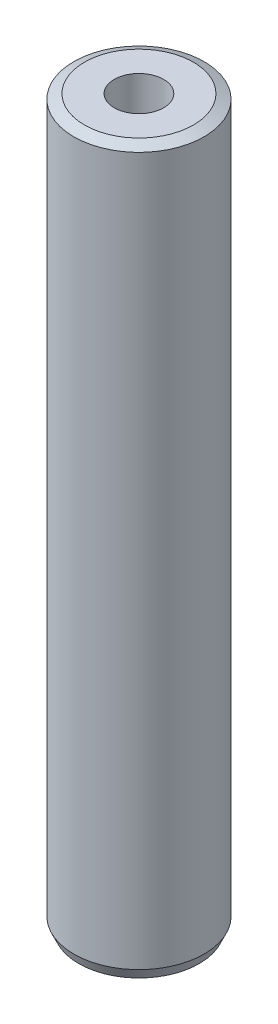
ISO-10303-21;
HEADER;
FILE_DESCRIPTION(('STEP AP214'),'2;1');
FILE_NAME('part.step','',(''),(''),'','','');
FILE_SCHEMA(('AUTOMOTIVE_DESIGN { 1 0 10303 214 1 1 1 1 }'));
ENDSEC;
DATA;
#1=APPLICATION_CONTEXT('core data for automotive mechanical design processes');
#2=APPLICATION_PROTOCOL_DEFINITION('international standard','automotive_design',2000,#1);
#3=PRODUCT_CONTEXT('',#1,'mechanical');
#4=PRODUCT('Part','Part','',(#3));
#5=PRODUCT_RELATED_PRODUCT_CATEGORY('part','',(#4));
#6=PRODUCT_DEFINITION_FORMATION('','',#4);
#7=PRODUCT_DEFINITION_CONTEXT('part definition',#1,'design');
#8=PRODUCT_DEFINITION('design','',#6,#7);
#9=PRODUCT_DEFINITION_SHAPE('','',#8);
#10=(LENGTH_UNIT() NAMED_UNIT(*) SI_UNIT(.MILLI.,.METRE.));
#11=(NAMED_UNIT(*) PLANE_ANGLE_UNIT() SI_UNIT($,.RADIAN.));
#12=(NAMED_UNIT(*) SI_UNIT($,.STERADIAN.) SOLID_ANGLE_UNIT());
#13=UNCERTAINTY_MEASURE_WITH_UNIT(LENGTH_MEASURE(1.E-05),#10,'distance_accuracy_value','');
#14=(GEOMETRIC_REPRESENTATION_CONTEXT(3) GLOBAL_UNCERTAINTY_ASSIGNED_CONTEXT((#13)) GLOBAL_UNIT_ASSIGNED_CONTEXT((#10,
#11,#12)) REPRESENTATION_CONTEXT('',''));
#15=CARTESIAN_POINT('',(0.,0.,0.));
#16=DIRECTION('',(0.,0.,1.));
#17=DIRECTION('',(1.,0.,0.));
#18=AXIS2_PLACEMENT_3D('',#15,#16,#17);
#19=CARTESIAN_POINT('',(0.,416.345028660656,0.));
#20=DIRECTION('',(0.,-1.,0.));
#21=DIRECTION('',(0.,0.,-1.));
#22=AXIS2_PLACEMENT_3D('',#19,#20,#21);
#23=CYLINDRICAL_SURFACE('',#22,37.5);
#24=CARTESIAN_POINT('',(0.,413.551676634569,0.));
#25=DIRECTION('',(0.,1.,0.));
#26=DIRECTION('',(0.,0.,1.));
#27=AXIS2_PLACEMENT_3D('',#24,#25,#26);
#28=CIRCLE('',#27,37.5);
#29=CARTESIAN_POINT('',(0.,413.551676634569,37.5));
#30=VERTEX_POINT('',#29);
#31=EDGE_CURVE('E50',#30,#30,#28,.F.);
#32=ORIENTED_EDGE('',*,*,#31,.T.);
#33=EDGE_LOOP('',(#32));
#34=FACE_BOUND('',#33,.T.);
#35=CARTESIAN_POINT('',(0.,6.15230423809254,0.));
#36=DIRECTION('',(0.,1.,0.));
#37=DIRECTION('',(0.,0.,1.));
#38=AXIS2_PLACEMENT_3D('',#35,#36,#37);
#39=CIRCLE('',#38,37.5);
#40=CARTESIAN_POINT('',(0.,6.15230423809254,37.5));
#41=VERTEX_POINT('',#40);
#42=EDGE_CURVE('E51',#41,#41,#39,.T.);
#43=ORIENTED_EDGE('',*,*,#42,.T.);
#44=EDGE_LOOP('',(#43));
#45=FACE_BOUND('',#44,.T.);
#46=ADVANCED_FACE('F39',(#34,#45),#23,.T.);
#47=CARTESIAN_POINT('',(0.,416.345028660656,0.));
#48=DIRECTION('',(0.,1.,0.));
#49=DIRECTION('',(0.,0.,1.));
#50=AXIS2_PLACEMENT_3D('',#47,#48,#49);
#51=PLANE('',#50);
#52=CARTESIAN_POINT('',(0.,416.345028660656,0.));
#53=DIRECTION('',(0.,1.,0.));
#54=DIRECTION('',(0.,0.,1.));
#55=AXIS2_PLACEMENT_3D('',#52,#53,#54);
#56=CIRCLE('',#55,31.3476957619075);
#57=CARTESIAN_POINT('',(0.,416.345028660656,31.3476957619075));
#58=VERTEX_POINT('',#57);
#59=EDGE_CURVE('E54',#58,#58,#56,.T.);
#60=ORIENTED_EDGE('',*,*,#59,.T.);
#61=EDGE_LOOP('',(#60));
#62=FACE_BOUND('',#61,.T.);
#63=CARTESIAN_POINT('',(0.,416.345028660656,0.));
#64=DIRECTION('',(0.,1.,0.));
#65=DIRECTION('',(0.,0.,1.));
#66=AXIS2_PLACEMENT_3D('',#63,#64,#65);
#67=CIRCLE('',#66,14.199533645004);
#68=CARTESIAN_POINT('',(0.,416.345028660656,14.199533645004));
#69=VERTEX_POINT('',#68);
#70=EDGE_CURVE('E58',#69,#69,#67,.T.);
#71=ORIENTED_EDGE('',*,*,#70,.F.);
#72=EDGE_LOOP('',(#71));
#73=FACE_BOUND('',#72,.T.);
#74=ADVANCED_FACE('F69',(#62,#73),#51,.T.);
#75=CARTESIAN_POINT('',(0.,0.,0.));
#76=DIRECTION('',(0.,1.,0.));
#77=DIRECTION('',(0.,0.,1.));
#78=AXIS2_PLACEMENT_3D('',#75,#76,#77);
#79=PLANE('',#78);
#80=CARTESIAN_POINT('',(0.,0.,0.));
#81=DIRECTION('',(0.,1.,0.));
#82=DIRECTION('',(0.,0.,1.));
#83=AXIS2_PLACEMENT_3D('',#80,#81,#82);
#84=CIRCLE('',#83,34.7066479739125);
#85=CARTESIAN_POINT('',(0.,0.,34.7066479739125));
#86=VERTEX_POINT('',#85);
#87=EDGE_CURVE('E10',#86,#86,#84,.F.);
#88=ORIENTED_EDGE('',*,*,#87,.T.);
#89=EDGE_LOOP('',(#88));
#90=FACE_BOUND('',#89,.T.);
#91=CARTESIAN_POINT('',(0.,0.,0.));
#92=DIRECTION('',(0.,1.,0.));
#93=DIRECTION('',(0.,0.,1.));
#94=AXIS2_PLACEMENT_3D('',#91,#92,#93);
#95=CIRCLE('',#94,14.199533645004);
#96=CARTESIAN_POINT('',(0.,0.,14.199533645004));
#97=VERTEX_POINT('',#96);
#98=EDGE_CURVE('E63',#97,#97,#95,.T.);
#99=ORIENTED_EDGE('',*,*,#98,.T.);
#100=EDGE_LOOP('',(#99));
#101=FACE_BOUND('',#100,.T.);
#102=ADVANCED_FACE('F75',(#90,#101),#79,.F.);
#103=CARTESIAN_POINT('',(0.,416.345028660656,0.));
#104=DIRECTION('',(0.,-1.,0.));
#105=DIRECTION('',(0.,0.,-1.));
#106=AXIS2_PLACEMENT_3D('',#103,#104,#105);
#107=CYLINDRICAL_SURFACE('',#106,14.199533645004);
#108=ORIENTED_EDGE('',*,*,#70,.T.);
#109=EDGE_LOOP('',(#108));
#110=FACE_BOUND('',#109,.T.);
#111=ORIENTED_EDGE('',*,*,#98,.F.);
#112=EDGE_LOOP('',(#111));
#113=FACE_BOUND('',#112,.T.);
#114=ADVANCED_FACE('F70',(#110,#113),#107,.F.);
#115=CARTESIAN_POINT('',(0.,416.345028660656,0.));
#116=DIRECTION('',(0.,-1.,0.));
#117=DIRECTION('',(0.,0.,-1.));
#118=AXIS2_PLACEMENT_3D('',#115,#116,#117);
#119=CONICAL_SURFACE('',#118,31.3476957619075,1.14459323356164);
#120=ORIENTED_EDGE('',*,*,#31,.F.);
#121=EDGE_LOOP('',(#120));
#122=FACE_BOUND('',#121,.T.);
#123=ORIENTED_EDGE('',*,*,#59,.F.);
#124=EDGE_LOOP('',(#123));
#125=FACE_BOUND('',#124,.T.);
#126=ADVANCED_FACE('F81',(#122,#125),#119,.T.);
#127=CARTESIAN_POINT('',(0.,6.15230423809254,0.));
#128=DIRECTION('',(0.,1.,0.));
#129=DIRECTION('',(0.,0.,1.));
#130=AXIS2_PLACEMENT_3D('',#127,#128,#129);
#131=CONICAL_SURFACE('',#130,37.5,0.426203093233252);
#132=ORIENTED_EDGE('',*,*,#87,.F.);
#133=EDGE_LOOP('',(#132));
#134=FACE_BOUND('',#133,.T.);
#135=ORIENTED_EDGE('',*,*,#42,.F.);
#136=EDGE_LOOP('',(#135));
#137=FACE_BOUND('',#136,.T.);
#138=ADVANCED_FACE('F45',(#134,#137),#131,.T.);
#139=CLOSED_SHELL('',(#46,#74,#102,#114,#126,#138));
#140=MANIFOLD_SOLID_BREP('B2',#139);
#141=ADVANCED_BREP_SHAPE_REPRESENTATION('',(#18,#140),#14);
#142=SHAPE_DEFINITION_REPRESENTATION(#9,#141);
ENDSEC;
END-ISO-10303-21;
